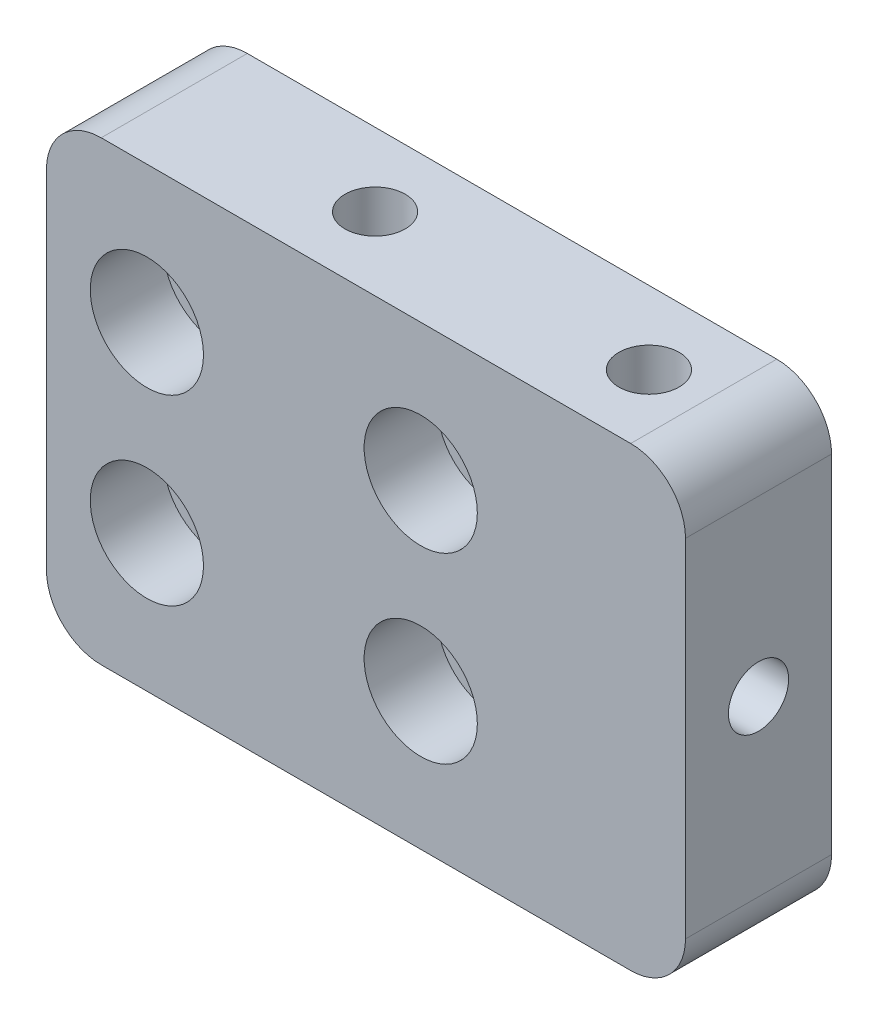
ISO-10303-21;
HEADER;
FILE_DESCRIPTION(('STEP AP214'),'2;1');
FILE_NAME('part.step','',(''),(''),'','','');
FILE_SCHEMA(('AUTOMOTIVE_DESIGN { 1 0 10303 214 1 1 1 1 }'));
ENDSEC;
DATA;
#1=APPLICATION_CONTEXT('core data for automotive mechanical design processes');
#2=APPLICATION_PROTOCOL_DEFINITION('international standard','automotive_design',2000,#1);
#3=PRODUCT_CONTEXT('',#1,'mechanical');
#4=PRODUCT('Part','Part','',(#3));
#5=PRODUCT_RELATED_PRODUCT_CATEGORY('part','',(#4));
#6=PRODUCT_DEFINITION_FORMATION('','',#4);
#7=PRODUCT_DEFINITION_CONTEXT('part definition',#1,'design');
#8=PRODUCT_DEFINITION('design','',#6,#7);
#9=PRODUCT_DEFINITION_SHAPE('','',#8);
#10=(LENGTH_UNIT() NAMED_UNIT(*) SI_UNIT(.MILLI.,.METRE.));
#11=(NAMED_UNIT(*) PLANE_ANGLE_UNIT() SI_UNIT($,.RADIAN.));
#12=(NAMED_UNIT(*) SI_UNIT($,.STERADIAN.) SOLID_ANGLE_UNIT());
#13=UNCERTAINTY_MEASURE_WITH_UNIT(LENGTH_MEASURE(1.E-05),#10,'distance_accuracy_value','');
#14=(GEOMETRIC_REPRESENTATION_CONTEXT(3) GLOBAL_UNCERTAINTY_ASSIGNED_CONTEXT((#13)) GLOBAL_UNIT_ASSIGNED_CONTEXT((#10,
#11,#12)) REPRESENTATION_CONTEXT('',''));
#15=CARTESIAN_POINT('',(0.,0.,0.));
#16=DIRECTION('',(0.,0.,1.));
#17=DIRECTION('',(1.,0.,0.));
#18=AXIS2_PLACEMENT_3D('',#15,#16,#17);
#19=CARTESIAN_POINT('',(11.4999999999974,-12.5,4.00000000000034));
#20=DIRECTION('',(0.,-1.,0.));
#21=DIRECTION('',(0.,0.,-1.));
#22=AXIS2_PLACEMENT_3D('',#19,#20,#21);
#23=CYLINDRICAL_SURFACE('',#22,1.64999999999999);
#24=CARTESIAN_POINT('',(11.4999999999974,-12.5,4.00000000000034));
#25=DIRECTION('',(0.,-1.,0.));
#26=DIRECTION('',(0.,0.,-1.));
#27=AXIS2_PLACEMENT_3D('',#24,#25,#26);
#28=CIRCLE('',#27,1.64999999999999);
#29=CARTESIAN_POINT('',(11.4999999999974,-12.5,2.35000000000035));
#30=VERTEX_POINT('',#29);
#31=EDGE_CURVE('E240',#30,#30,#28,.T.);
#32=ORIENTED_EDGE('',*,*,#31,.T.);
#33=EDGE_LOOP('',(#32));
#34=FACE_BOUND('',#33,.T.);
#35=CARTESIAN_POINT('',(11.4999999999974,9.07056374455095E-09,3.99999999995289));
#36=DIRECTION('',(0.707106781186547,-0.707106781186547,0.));
#37=DIRECTION('',(-0.707106781186547,-0.707106781186547,0.));
#38=AXIS2_PLACEMENT_3D('',#35,#36,#37);
#39=ELLIPSE('',#38,2.33345237791559,1.64999999999999);
#40=CARTESIAN_POINT('',(11.4999999999974,9.07056374455095E-09,2.3499999999529));
#41=VERTEX_POINT('',#40);
#42=CARTESIAN_POINT('',(11.4999999999974,9.07056374455095E-09,5.64999999995288));
#43=VERTEX_POINT('',#42);
#44=EDGE_CURVE('E52',#41,#43,#39,.F.);
#45=ORIENTED_EDGE('',*,*,#44,.T.);
#46=CARTESIAN_POINT('',(11.4999999999974,9.07056374455095E-09,3.99999999995289));
#47=DIRECTION('',(-0.707106781186547,-0.707106781186547,0.));
#48=DIRECTION('',(0.707106781186547,-0.707106781186547,0.));
#49=AXIS2_PLACEMENT_3D('',#46,#47,#48);
#50=ELLIPSE('',#49,2.33345237791559,1.64999999999999);
#51=EDGE_CURVE('E249',#43,#41,#50,.F.);
#52=ORIENTED_EDGE('',*,*,#51,.T.);
#53=EDGE_LOOP('',(#45,#52));
#54=FACE_BOUND('',#53,.T.);
#55=ADVANCED_FACE('F38',(#34,#54),#23,.F.);
#56=CARTESIAN_POINT('',(-3.50000000000261,-12.5,4.00000000000064));
#57=DIRECTION('',(0.,-1.,0.));
#58=DIRECTION('',(0.,0.,-1.));
#59=AXIS2_PLACEMENT_3D('',#56,#57,#58);
#60=CYLINDRICAL_SURFACE('',#59,1.64999999999999);
#61=CARTESIAN_POINT('',(-3.50000000000261,-12.5,4.00000000000064));
#62=DIRECTION('',(0.,-1.,0.));
#63=DIRECTION('',(0.,0.,-1.));
#64=AXIS2_PLACEMENT_3D('',#61,#62,#63);
#65=CIRCLE('',#64,1.64999999999999);
#66=CARTESIAN_POINT('',(-3.50000000000261,-12.5,2.35000000000065));
#67=VERTEX_POINT('',#66);
#68=EDGE_CURVE('E246',#67,#67,#65,.T.);
#69=ORIENTED_EDGE('',*,*,#68,.T.);
#70=EDGE_LOOP('',(#69));
#71=FACE_BOUND('',#70,.T.);
#72=CARTESIAN_POINT('',(-3.50000000000261,9.07056374455095E-09,3.99999999995304));
#73=DIRECTION('',(0.707106781186547,-0.707106781186547,0.));
#74=DIRECTION('',(-0.707106781186547,-0.707106781186547,0.));
#75=AXIS2_PLACEMENT_3D('',#72,#73,#74);
#76=ELLIPSE('',#75,2.33345237791559,1.64999999999999);
#77=CARTESIAN_POINT('',(-3.50000000000261,9.07056374455095E-09,2.34999999995305));
#78=VERTEX_POINT('',#77);
#79=CARTESIAN_POINT('',(-3.50000000000261,9.07056374455095E-09,5.64999999995304));
#80=VERTEX_POINT('',#79);
#81=EDGE_CURVE('E58',#78,#80,#76,.F.);
#82=ORIENTED_EDGE('',*,*,#81,.T.);
#83=CARTESIAN_POINT('',(-3.50000000000261,9.07056374455095E-09,3.99999999995304));
#84=DIRECTION('',(-0.707106781186547,-0.707106781186547,0.));
#85=DIRECTION('',(0.707106781186547,-0.707106781186547,0.));
#86=AXIS2_PLACEMENT_3D('',#83,#84,#85);
#87=ELLIPSE('',#86,2.33345237791559,1.64999999999999);
#88=EDGE_CURVE('E11',#80,#78,#87,.F.);
#89=ORIENTED_EDGE('',*,*,#88,.T.);
#90=EDGE_LOOP('',(#82,#89));
#91=FACE_BOUND('',#90,.T.);
#92=ADVANCED_FACE('F126',(#71,#91),#60,.F.);
#93=CARTESIAN_POINT('',(2.9999999999998,5.00000000806245,0.));
#94=DIRECTION('',(0.,0.,1.));
#95=DIRECTION('',(1.,0.,0.));
#96=AXIS2_PLACEMENT_3D('',#93,#94,#95);
#97=CYLINDRICAL_SURFACE('',#96,1.52499999822959);
#98=CARTESIAN_POINT('',(2.9999999999998,5.00000000806245,0.));
#99=DIRECTION('',(0.,0.,1.));
#100=DIRECTION('',(1.,0.,0.));
#101=AXIS2_PLACEMENT_3D('',#98,#99,#100);
#102=CIRCLE('',#101,1.52499999822959);
#103=CARTESIAN_POINT('',(4.52499999822939,5.00000000806245,0.));
#104=VERTEX_POINT('',#103);
#105=EDGE_CURVE('E193',#104,#104,#102,.T.);
#106=ORIENTED_EDGE('',*,*,#105,.F.);
#107=EDGE_LOOP('',(#106));
#108=FACE_BOUND('',#107,.T.);
#109=CARTESIAN_POINT('',(2.9999999999998,5.00000000806245,4.));
#110=DIRECTION('',(0.,0.,1.));
#111=DIRECTION('',(1.,0.,0.));
#112=AXIS2_PLACEMENT_3D('',#109,#110,#111);
#113=CIRCLE('',#112,1.52499999822959);
#114=CARTESIAN_POINT('',(4.52499999822939,5.00000000806245,4.));
#115=VERTEX_POINT('',#114);
#116=EDGE_CURVE('E130',#115,#115,#113,.F.);
#117=ORIENTED_EDGE('',*,*,#116,.F.);
#118=EDGE_LOOP('',(#117));
#119=FACE_BOUND('',#118,.T.);
#120=ADVANCED_FACE('F326',(#108,#119),#97,.F.);
#121=CARTESIAN_POINT('',(-12.0000000000002,-4.99999999193755,0.));
#122=DIRECTION('',(0.,0.,1.));
#123=DIRECTION('',(1.,0.,0.));
#124=AXIS2_PLACEMENT_3D('',#121,#122,#123);
#125=CYLINDRICAL_SURFACE('',#124,1.52499999822906);
#126=CARTESIAN_POINT('',(-12.0000000000002,-4.99999999193755,0.));
#127=DIRECTION('',(0.,0.,1.));
#128=DIRECTION('',(1.,0.,0.));
#129=AXIS2_PLACEMENT_3D('',#126,#127,#128);
#130=CIRCLE('',#129,1.52499999822906);
#131=CARTESIAN_POINT('',(-10.4750000017711,-4.99999999193755,0.));
#132=VERTEX_POINT('',#131);
#133=EDGE_CURVE('E133',#132,#132,#130,.T.);
#134=ORIENTED_EDGE('',*,*,#133,.F.);
#135=EDGE_LOOP('',(#134));
#136=FACE_BOUND('',#135,.T.);
#137=CARTESIAN_POINT('',(-12.0000000000002,-4.99999999193755,4.));
#138=DIRECTION('',(0.,0.,1.));
#139=DIRECTION('',(1.,0.,0.));
#140=AXIS2_PLACEMENT_3D('',#137,#138,#139);
#141=CIRCLE('',#140,1.52499999822906);
#142=CARTESIAN_POINT('',(-10.4750000017711,-4.99999999193755,4.));
#143=VERTEX_POINT('',#142);
#144=EDGE_CURVE('E134',#143,#143,#141,.F.);
#145=ORIENTED_EDGE('',*,*,#144,.F.);
#146=EDGE_LOOP('',(#145));
#147=FACE_BOUND('',#146,.T.);
#148=ADVANCED_FACE('F380',(#136,#147),#125,.F.);
#149=CARTESIAN_POINT('',(-12.0000000000002,5.00000000806245,0.));
#150=DIRECTION('',(0.,0.,1.));
#151=DIRECTION('',(1.,0.,0.));
#152=AXIS2_PLACEMENT_3D('',#149,#150,#151);
#153=CYLINDRICAL_SURFACE('',#152,1.52499999822907);
#154=CARTESIAN_POINT('',(-12.0000000000002,5.00000000806245,0.));
#155=DIRECTION('',(0.,0.,1.));
#156=DIRECTION('',(1.,0.,0.));
#157=AXIS2_PLACEMENT_3D('',#154,#155,#156);
#158=CIRCLE('',#157,1.52499999822907);
#159=CARTESIAN_POINT('',(-10.4750000017711,5.00000000806245,0.));
#160=VERTEX_POINT('',#159);
#161=EDGE_CURVE('E207',#160,#160,#158,.T.);
#162=ORIENTED_EDGE('',*,*,#161,.F.);
#163=EDGE_LOOP('',(#162));
#164=FACE_BOUND('',#163,.T.);
#165=CARTESIAN_POINT('',(-12.0000000000002,5.00000000806245,4.));
#166=DIRECTION('',(0.,0.,1.));
#167=DIRECTION('',(1.,0.,0.));
#168=AXIS2_PLACEMENT_3D('',#165,#166,#167);
#169=CIRCLE('',#168,1.52499999822907);
#170=CARTESIAN_POINT('',(-10.4750000017711,5.00000000806245,4.));
#171=VERTEX_POINT('',#170);
#172=EDGE_CURVE('E137',#171,#171,#169,.F.);
#173=ORIENTED_EDGE('',*,*,#172,.F.);
#174=EDGE_LOOP('',(#173));
#175=FACE_BOUND('',#174,.T.);
#176=ADVANCED_FACE('F383',(#164,#175),#153,.F.);
#177=CARTESIAN_POINT('',(2.9999999999998,-4.99999999193757,0.));
#178=DIRECTION('',(0.,0.,1.));
#179=DIRECTION('',(1.,0.,0.));
#180=AXIS2_PLACEMENT_3D('',#177,#178,#179);
#181=CYLINDRICAL_SURFACE('',#180,1.52499999822959);
#182=CARTESIAN_POINT('',(2.9999999999998,-4.99999999193757,0.));
#183=DIRECTION('',(0.,0.,1.));
#184=DIRECTION('',(1.,0.,0.));
#185=AXIS2_PLACEMENT_3D('',#182,#183,#184);
#186=CIRCLE('',#185,1.52499999822959);
#187=CARTESIAN_POINT('',(4.52499999822939,-4.99999999193757,0.));
#188=VERTEX_POINT('',#187);
#189=EDGE_CURVE('E206',#188,#188,#186,.T.);
#190=ORIENTED_EDGE('',*,*,#189,.F.);
#191=EDGE_LOOP('',(#190));
#192=FACE_BOUND('',#191,.T.);
#193=CARTESIAN_POINT('',(2.9999999999998,-4.99999999193757,4.));
#194=DIRECTION('',(0.,0.,1.));
#195=DIRECTION('',(1.,0.,0.));
#196=AXIS2_PLACEMENT_3D('',#193,#194,#195);
#197=CIRCLE('',#196,1.52499999822959);
#198=CARTESIAN_POINT('',(4.52499999822939,-4.99999999193757,4.));
#199=VERTEX_POINT('',#198);
#200=EDGE_CURVE('E140',#199,#199,#197,.F.);
#201=ORIENTED_EDGE('',*,*,#200,.F.);
#202=EDGE_LOOP('',(#201));
#203=FACE_BOUND('',#202,.T.);
#204=ADVANCED_FACE('F349',(#192,#203),#181,.F.);
#205=CARTESIAN_POINT('',(17.5,-12.5,8.));
#206=DIRECTION('',(-1.,0.,0.));
#207=DIRECTION('',(0.,0.,1.));
#208=AXIS2_PLACEMENT_3D('',#205,#206,#207);
#209=PLANE('',#208);
#210=CARTESIAN_POINT('',(17.5,9.07056374455095E-09,3.99999999990545));
#211=DIRECTION('',(-1.,0.,0.));
#212=DIRECTION('',(0.,0.,1.));
#213=AXIS2_PLACEMENT_3D('',#210,#211,#212);
#214=CIRCLE('',#213,1.64999999999999);
#215=CARTESIAN_POINT('',(17.5,9.07056374455095E-09,5.64999999990544));
#216=VERTEX_POINT('',#215);
#217=EDGE_CURVE('E258',#216,#216,#214,.T.);
#218=ORIENTED_EDGE('',*,*,#217,.T.);
#219=EDGE_LOOP('',(#218));
#220=FACE_BOUND('',#219,.T.);
#221=DIRECTION('',(0.,1.,0.));
#222=VECTOR('',#221,1.);
#223=CARTESIAN_POINT('',(17.5,-12.5,8.));
#224=LINE('',#223,#222);
#225=CARTESIAN_POINT('',(17.5,-9.5,8.));
#226=VERTEX_POINT('',#225);
#227=CARTESIAN_POINT('',(17.5,9.5,8.));
#228=VERTEX_POINT('',#227);
#229=EDGE_CURVE('E183',#226,#228,#224,.T.);
#230=ORIENTED_EDGE('',*,*,#229,.F.);
#231=DIRECTION('',(0.,0.,-1.));
#232=VECTOR('',#231,1.);
#233=CARTESIAN_POINT('',(17.5,-9.5,8.));
#234=LINE('',#233,#232);
#235=CARTESIAN_POINT('',(17.5,-9.5,0.));
#236=VERTEX_POINT('',#235);
#237=EDGE_CURVE('E174',#226,#236,#234,.T.);
#238=ORIENTED_EDGE('',*,*,#237,.T.);
#239=DIRECTION('',(0.,1.,0.));
#240=VECTOR('',#239,1.);
#241=CARTESIAN_POINT('',(17.5,-12.5,0.));
#242=LINE('',#241,#240);
#243=CARTESIAN_POINT('',(17.5,9.5,0.));
#244=VERTEX_POINT('',#243);
#245=EDGE_CURVE('E190',#236,#244,#242,.T.);
#246=ORIENTED_EDGE('',*,*,#245,.T.);
#247=DIRECTION('',(0.,0.,-1.));
#248=VECTOR('',#247,1.);
#249=CARTESIAN_POINT('',(17.5,9.5,8.));
#250=LINE('',#249,#248);
#251=EDGE_CURVE('E177',#244,#228,#250,.F.);
#252=ORIENTED_EDGE('',*,*,#251,.T.);
#253=EDGE_LOOP('',(#230,#238,#246,#252));
#254=FACE_BOUND('',#253,.T.);
#255=ADVANCED_FACE('F294',(#220,#254),#209,.F.);
#256=CARTESIAN_POINT('',(-17.5,12.5,8.));
#257=DIRECTION('',(0.,-1.,0.));
#258=DIRECTION('',(0.,0.,-1.));
#259=AXIS2_PLACEMENT_3D('',#256,#257,#258);
#260=PLANE('',#259);
#261=CARTESIAN_POINT('',(-3.50000000000261,12.5,4.00000000000064));
#262=DIRECTION('',(0.,-1.,0.));
#263=DIRECTION('',(0.,0.,-1.));
#264=AXIS2_PLACEMENT_3D('',#261,#262,#263);
#265=CIRCLE('',#264,1.65);
#266=CARTESIAN_POINT('',(-3.50000000000261,12.5,2.35000000000065));
#267=VERTEX_POINT('',#266);
#268=EDGE_CURVE('E243',#267,#267,#265,.T.);
#269=ORIENTED_EDGE('',*,*,#268,.T.);
#270=EDGE_LOOP('',(#269));
#271=FACE_BOUND('',#270,.T.);
#272=CARTESIAN_POINT('',(11.4999999999974,12.5,4.00000000000034));
#273=DIRECTION('',(0.,-1.,0.));
#274=DIRECTION('',(0.,0.,-1.));
#275=AXIS2_PLACEMENT_3D('',#272,#273,#274);
#276=CIRCLE('',#275,1.65);
#277=CARTESIAN_POINT('',(11.4999999999974,12.5,2.35000000000034));
#278=VERTEX_POINT('',#277);
#279=EDGE_CURVE('E235',#278,#278,#276,.T.);
#280=ORIENTED_EDGE('',*,*,#279,.T.);
#281=EDGE_LOOP('',(#280));
#282=FACE_BOUND('',#281,.T.);
#283=DIRECTION('',(-1.,0.,0.));
#284=VECTOR('',#283,1.);
#285=CARTESIAN_POINT('',(-17.5,12.5,8.));
#286=LINE('',#285,#284);
#287=CARTESIAN_POINT('',(14.5,12.5,8.));
#288=VERTEX_POINT('',#287);
#289=CARTESIAN_POINT('',(-14.5,12.5,8.));
#290=VERTEX_POINT('',#289);
#291=EDGE_CURVE('E199',#288,#290,#286,.T.);
#292=ORIENTED_EDGE('',*,*,#291,.F.);
#293=DIRECTION('',(0.,0.,-1.));
#294=VECTOR('',#293,1.);
#295=CARTESIAN_POINT('',(14.5,12.5,8.));
#296=LINE('',#295,#294);
#297=CARTESIAN_POINT('',(14.5,12.5,0.));
#298=VERTEX_POINT('',#297);
#299=EDGE_CURVE('E124',#288,#298,#296,.T.);
#300=ORIENTED_EDGE('',*,*,#299,.T.);
#301=DIRECTION('',(-1.,0.,0.));
#302=VECTOR('',#301,1.);
#303=CARTESIAN_POINT('',(-17.5,12.5,0.));
#304=LINE('',#303,#302);
#305=CARTESIAN_POINT('',(-14.5,12.5,0.));
#306=VERTEX_POINT('',#305);
#307=EDGE_CURVE('E187',#298,#306,#304,.T.);
#308=ORIENTED_EDGE('',*,*,#307,.T.);
#309=DIRECTION('',(0.,0.,-1.));
#310=VECTOR('',#309,1.);
#311=CARTESIAN_POINT('',(-14.5,12.5,8.));
#312=LINE('',#311,#310);
#313=EDGE_CURVE('E146',#306,#290,#312,.F.);
#314=ORIENTED_EDGE('',*,*,#313,.T.);
#315=EDGE_LOOP('',(#292,#300,#308,#314));
#316=FACE_BOUND('',#315,.T.);
#317=ADVANCED_FACE('F270',(#271,#282,#316),#260,.F.);
#318=CARTESIAN_POINT('',(-17.5,-12.5,8.));
#319=DIRECTION('',(1.,0.,0.));
#320=DIRECTION('',(0.,0.,-1.));
#321=AXIS2_PLACEMENT_3D('',#318,#319,#320);
#322=PLANE('',#321);
#323=CARTESIAN_POINT('',(-17.5,9.07056374455095E-09,3.99999999990545));
#324=DIRECTION('',(-1.,0.,0.));
#325=DIRECTION('',(0.,0.,1.));
#326=AXIS2_PLACEMENT_3D('',#323,#324,#325);
#327=CIRCLE('',#326,1.64999999999999);
#328=CARTESIAN_POINT('',(-17.5,9.07056374455095E-09,5.64999999990544));
#329=VERTEX_POINT('',#328);
#330=EDGE_CURVE('E261',#329,#329,#327,.T.);
#331=ORIENTED_EDGE('',*,*,#330,.F.);
#332=EDGE_LOOP('',(#331));
#333=FACE_BOUND('',#332,.T.);
#334=DIRECTION('',(0.,-1.,0.));
#335=VECTOR('',#334,1.);
#336=CARTESIAN_POINT('',(-17.5,-12.5,0.));
#337=LINE('',#336,#335);
#338=CARTESIAN_POINT('',(-17.5,9.5,0.));
#339=VERTEX_POINT('',#338);
#340=CARTESIAN_POINT('',(-17.5,-9.5,0.));
#341=VERTEX_POINT('',#340);
#342=EDGE_CURVE('E184',#339,#341,#337,.T.);
#343=ORIENTED_EDGE('',*,*,#342,.T.);
#344=DIRECTION('',(0.,0.,-1.));
#345=VECTOR('',#344,1.);
#346=CARTESIAN_POINT('',(-17.5,-9.5,8.));
#347=LINE('',#346,#345);
#348=CARTESIAN_POINT('',(-17.5,-9.5,8.));
#349=VERTEX_POINT('',#348);
#350=EDGE_CURVE('E148',#341,#349,#347,.F.);
#351=ORIENTED_EDGE('',*,*,#350,.T.);
#352=DIRECTION('',(0.,-1.,0.));
#353=VECTOR('',#352,1.);
#354=CARTESIAN_POINT('',(-17.5,-12.5,8.));
#355=LINE('',#354,#353);
#356=CARTESIAN_POINT('',(-17.5,9.5,8.));
#357=VERTEX_POINT('',#356);
#358=EDGE_CURVE('E196',#357,#349,#355,.T.);
#359=ORIENTED_EDGE('',*,*,#358,.F.);
#360=DIRECTION('',(0.,0.,-1.));
#361=VECTOR('',#360,1.);
#362=CARTESIAN_POINT('',(-17.5,9.5,8.));
#363=LINE('',#362,#361);
#364=EDGE_CURVE('E150',#357,#339,#363,.T.);
#365=ORIENTED_EDGE('',*,*,#364,.T.);
#366=EDGE_LOOP('',(#343,#351,#359,#365));
#367=FACE_BOUND('',#366,.T.);
#368=ADVANCED_FACE('F266',(#333,#367),#322,.F.);
#369=CARTESIAN_POINT('',(-17.5,-12.5,8.));
#370=DIRECTION('',(0.,1.,0.));
#371=DIRECTION('',(0.,0.,1.));
#372=AXIS2_PLACEMENT_3D('',#369,#370,#371);
#373=PLANE('',#372);
#374=ORIENTED_EDGE('',*,*,#68,.F.);
#375=EDGE_LOOP('',(#374));
#376=FACE_BOUND('',#375,.T.);
#377=ORIENTED_EDGE('',*,*,#31,.F.);
#378=EDGE_LOOP('',(#377));
#379=FACE_BOUND('',#378,.T.);
#380=DIRECTION('',(1.,0.,0.));
#381=VECTOR('',#380,1.);
#382=CARTESIAN_POINT('',(-17.5,-12.5,0.));
#383=LINE('',#382,#381);
#384=CARTESIAN_POINT('',(-14.5,-12.5,0.));
#385=VERTEX_POINT('',#384);
#386=CARTESIAN_POINT('',(14.5,-12.5,0.));
#387=VERTEX_POINT('',#386);
#388=EDGE_CURVE('E180',#385,#387,#383,.T.);
#389=ORIENTED_EDGE('',*,*,#388,.T.);
#390=DIRECTION('',(0.,0.,-1.));
#391=VECTOR('',#390,1.);
#392=CARTESIAN_POINT('',(14.5,-12.5,8.));
#393=LINE('',#392,#391);
#394=CARTESIAN_POINT('',(14.5,-12.5,8.));
#395=VERTEX_POINT('',#394);
#396=EDGE_CURVE('E161',#387,#395,#393,.F.);
#397=ORIENTED_EDGE('',*,*,#396,.T.);
#398=DIRECTION('',(1.,0.,0.));
#399=VECTOR('',#398,1.);
#400=CARTESIAN_POINT('',(-17.5,-12.5,8.));
#401=LINE('',#400,#399);
#402=CARTESIAN_POINT('',(-14.5,-12.5,8.));
#403=VERTEX_POINT('',#402);
#404=EDGE_CURVE('E179',#403,#395,#401,.T.);
#405=ORIENTED_EDGE('',*,*,#404,.F.);
#406=DIRECTION('',(0.,0.,-1.));
#407=VECTOR('',#406,1.);
#408=CARTESIAN_POINT('',(-14.5,-12.5,8.));
#409=LINE('',#408,#407);
#410=EDGE_CURVE('E163',#403,#385,#409,.T.);
#411=ORIENTED_EDGE('',*,*,#410,.T.);
#412=EDGE_LOOP('',(#389,#397,#405,#411));
#413=FACE_BOUND('',#412,.T.);
#414=ADVANCED_FACE('F269',(#376,#379,#413),#373,.F.);
#415=CARTESIAN_POINT('',(0.,0.,8.));
#416=DIRECTION('',(0.,0.,-1.));
#417=DIRECTION('',(-1.,0.,0.));
#418=AXIS2_PLACEMENT_3D('',#415,#416,#417);
#419=PLANE('',#418);
#420=CARTESIAN_POINT('',(-12.0000000000002,5.00000000806245,8.));
#421=DIRECTION('',(0.,0.,1.));
#422=DIRECTION('',(1.,0.,0.));
#423=AXIS2_PLACEMENT_3D('',#420,#421,#422);
#424=CIRCLE('',#423,3.09999999822907);
#425=CARTESIAN_POINT('',(-8.90000000177111,5.00000000806245,8.));
#426=VERTEX_POINT('',#425);
#427=EDGE_CURVE('E227',#426,#426,#424,.T.);
#428=ORIENTED_EDGE('',*,*,#427,.F.);
#429=EDGE_LOOP('',(#428));
#430=FACE_BOUND('',#429,.T.);
#431=CARTESIAN_POINT('',(2.9999999999998,-4.99999999193757,8.));
#432=DIRECTION('',(0.,0.,1.));
#433=DIRECTION('',(1.,0.,0.));
#434=AXIS2_PLACEMENT_3D('',#431,#432,#433);
#435=CIRCLE('',#434,3.09999999822959);
#436=CARTESIAN_POINT('',(6.09999999822939,-4.99999999193757,8.));
#437=VERTEX_POINT('',#436);
#438=EDGE_CURVE('E220',#437,#437,#435,.T.);
#439=ORIENTED_EDGE('',*,*,#438,.F.);
#440=EDGE_LOOP('',(#439));
#441=FACE_BOUND('',#440,.T.);
#442=CARTESIAN_POINT('',(-12.0000000000002,-4.99999999193755,8.));
#443=DIRECTION('',(0.,0.,1.));
#444=DIRECTION('',(1.,0.,0.));
#445=AXIS2_PLACEMENT_3D('',#442,#443,#444);
#446=CIRCLE('',#445,3.09999999822906);
#447=CARTESIAN_POINT('',(-8.90000000177111,-4.99999999193755,8.));
#448=VERTEX_POINT('',#447);
#449=EDGE_CURVE('E232',#448,#448,#446,.T.);
#450=ORIENTED_EDGE('',*,*,#449,.F.);
#451=EDGE_LOOP('',(#450));
#452=FACE_BOUND('',#451,.T.);
#453=CARTESIAN_POINT('',(2.9999999999998,5.00000000806245,8.));
#454=DIRECTION('',(0.,0.,1.));
#455=DIRECTION('',(1.,0.,0.));
#456=AXIS2_PLACEMENT_3D('',#453,#454,#455);
#457=CIRCLE('',#456,3.09999999822959);
#458=CARTESIAN_POINT('',(6.09999999822939,5.00000000806245,8.));
#459=VERTEX_POINT('',#458);
#460=EDGE_CURVE('E214',#459,#459,#457,.T.);
#461=ORIENTED_EDGE('',*,*,#460,.F.);
#462=EDGE_LOOP('',(#461));
#463=FACE_BOUND('',#462,.T.);
#464=ORIENTED_EDGE('',*,*,#404,.T.);
#465=CARTESIAN_POINT('',(14.5,-9.5,8.));
#466=DIRECTION('',(0.,0.,-1.));
#467=DIRECTION('',(-1.,0.,0.));
#468=AXIS2_PLACEMENT_3D('',#465,#466,#467);
#469=CIRCLE('',#468,3.);
#470=EDGE_CURVE('E153',#395,#226,#469,.F.);
#471=ORIENTED_EDGE('',*,*,#470,.T.);
#472=ORIENTED_EDGE('',*,*,#229,.T.);
#473=CARTESIAN_POINT('',(14.5,9.5,8.));
#474=DIRECTION('',(0.,0.,-1.));
#475=DIRECTION('',(-1.,0.,0.));
#476=AXIS2_PLACEMENT_3D('',#473,#474,#475);
#477=CIRCLE('',#476,3.);
#478=EDGE_CURVE('E157',#228,#288,#477,.F.);
#479=ORIENTED_EDGE('',*,*,#478,.T.);
#480=ORIENTED_EDGE('',*,*,#291,.T.);
#481=CARTESIAN_POINT('',(-14.5,9.5,8.));
#482=DIRECTION('',(0.,0.,-1.));
#483=DIRECTION('',(-1.,0.,0.));
#484=AXIS2_PLACEMENT_3D('',#481,#482,#483);
#485=CIRCLE('',#484,3.);
#486=EDGE_CURVE('E159',#290,#357,#485,.F.);
#487=ORIENTED_EDGE('',*,*,#486,.T.);
#488=ORIENTED_EDGE('',*,*,#358,.T.);
#489=CARTESIAN_POINT('',(-14.5,-9.5,8.));
#490=DIRECTION('',(0.,0.,-1.));
#491=DIRECTION('',(-1.,0.,0.));
#492=AXIS2_PLACEMENT_3D('',#489,#490,#491);
#493=CIRCLE('',#492,3.);
#494=EDGE_CURVE('E155',#349,#403,#493,.F.);
#495=ORIENTED_EDGE('',*,*,#494,.T.);
#496=EDGE_LOOP('',(#464,#471,#472,#479,#480,#487,#488,#495));
#497=FACE_BOUND('',#496,.T.);
#498=ADVANCED_FACE('F283',(#430,#441,#452,#463,#497),#419,.F.);
#499=CARTESIAN_POINT('',(0.,0.,0.));
#500=DIRECTION('',(0.,0.,-1.));
#501=DIRECTION('',(-1.,0.,0.));
#502=AXIS2_PLACEMENT_3D('',#499,#500,#501);
#503=PLANE('',#502);
#504=ORIENTED_EDGE('',*,*,#189,.T.);
#505=EDGE_LOOP('',(#504));
#506=FACE_BOUND('',#505,.T.);
#507=ORIENTED_EDGE('',*,*,#161,.T.);
#508=EDGE_LOOP('',(#507));
#509=FACE_BOUND('',#508,.T.);
#510=ORIENTED_EDGE('',*,*,#133,.T.);
#511=EDGE_LOOP('',(#510));
#512=FACE_BOUND('',#511,.T.);
#513=ORIENTED_EDGE('',*,*,#105,.T.);
#514=EDGE_LOOP('',(#513));
#515=FACE_BOUND('',#514,.T.);
#516=ORIENTED_EDGE('',*,*,#245,.F.);
#517=CARTESIAN_POINT('',(14.5,-9.5,0.));
#518=DIRECTION('',(0.,0.,-1.));
#519=DIRECTION('',(-1.,0.,0.));
#520=AXIS2_PLACEMENT_3D('',#517,#518,#519);
#521=CIRCLE('',#520,3.);
#522=EDGE_CURVE('E166',#236,#387,#521,.T.);
#523=ORIENTED_EDGE('',*,*,#522,.T.);
#524=ORIENTED_EDGE('',*,*,#388,.F.);
#525=CARTESIAN_POINT('',(-14.5,-9.5,0.));
#526=DIRECTION('',(0.,0.,-1.));
#527=DIRECTION('',(-1.,0.,0.));
#528=AXIS2_PLACEMENT_3D('',#525,#526,#527);
#529=CIRCLE('',#528,3.);
#530=EDGE_CURVE('E168',#385,#341,#529,.T.);
#531=ORIENTED_EDGE('',*,*,#530,.T.);
#532=ORIENTED_EDGE('',*,*,#342,.F.);
#533=CARTESIAN_POINT('',(-14.5,9.5,0.));
#534=DIRECTION('',(0.,0.,-1.));
#535=DIRECTION('',(-1.,0.,0.));
#536=AXIS2_PLACEMENT_3D('',#533,#534,#535);
#537=CIRCLE('',#536,3.);
#538=EDGE_CURVE('E172',#339,#306,#537,.T.);
#539=ORIENTED_EDGE('',*,*,#538,.T.);
#540=ORIENTED_EDGE('',*,*,#307,.F.);
#541=CARTESIAN_POINT('',(14.5,9.5,0.));
#542=DIRECTION('',(0.,0.,-1.));
#543=DIRECTION('',(-1.,0.,0.));
#544=AXIS2_PLACEMENT_3D('',#541,#542,#543);
#545=CIRCLE('',#544,3.);
#546=EDGE_CURVE('E170',#298,#244,#545,.T.);
#547=ORIENTED_EDGE('',*,*,#546,.T.);
#548=EDGE_LOOP('',(#516,#523,#524,#531,#532,#539,#540,#547));
#549=FACE_BOUND('',#548,.T.);
#550=ADVANCED_FACE('F306',(#506,#509,#512,#515,#549),#503,.T.);
#551=CARTESIAN_POINT('',(14.5,-9.5,8.));
#552=DIRECTION('',(0.,0.,-1.));
#553=DIRECTION('',(-1.,0.,0.));
#554=AXIS2_PLACEMENT_3D('',#551,#552,#553);
#555=CYLINDRICAL_SURFACE('',#554,3.);
#556=ORIENTED_EDGE('',*,*,#470,.F.);
#557=ORIENTED_EDGE('',*,*,#396,.F.);
#558=ORIENTED_EDGE('',*,*,#522,.F.);
#559=ORIENTED_EDGE('',*,*,#237,.F.);
#560=EDGE_LOOP('',(#556,#557,#558,#559));
#561=FACE_BOUND('',#560,.T.);
#562=ADVANCED_FACE('F289',(#561),#555,.T.);
#563=CARTESIAN_POINT('',(-14.5,-9.5,8.));
#564=DIRECTION('',(0.,0.,-1.));
#565=DIRECTION('',(-1.,0.,0.));
#566=AXIS2_PLACEMENT_3D('',#563,#564,#565);
#567=CYLINDRICAL_SURFACE('',#566,3.);
#568=ORIENTED_EDGE('',*,*,#494,.F.);
#569=ORIENTED_EDGE('',*,*,#350,.F.);
#570=ORIENTED_EDGE('',*,*,#530,.F.);
#571=ORIENTED_EDGE('',*,*,#410,.F.);
#572=EDGE_LOOP('',(#568,#569,#570,#571));
#573=FACE_BOUND('',#572,.T.);
#574=ADVANCED_FACE('F279',(#573),#567,.T.);
#575=CARTESIAN_POINT('',(14.5,9.5,8.));
#576=DIRECTION('',(0.,0.,-1.));
#577=DIRECTION('',(-1.,0.,0.));
#578=AXIS2_PLACEMENT_3D('',#575,#576,#577);
#579=CYLINDRICAL_SURFACE('',#578,3.);
#580=ORIENTED_EDGE('',*,*,#478,.F.);
#581=ORIENTED_EDGE('',*,*,#251,.F.);
#582=ORIENTED_EDGE('',*,*,#546,.F.);
#583=ORIENTED_EDGE('',*,*,#299,.F.);
#584=EDGE_LOOP('',(#580,#581,#582,#583));
#585=FACE_BOUND('',#584,.T.);
#586=ADVANCED_FACE('F298',(#585),#579,.T.);
#587=CARTESIAN_POINT('',(-14.5,9.5,8.));
#588=DIRECTION('',(0.,0.,-1.));
#589=DIRECTION('',(-1.,0.,0.));
#590=AXIS2_PLACEMENT_3D('',#587,#588,#589);
#591=CYLINDRICAL_SURFACE('',#590,3.);
#592=ORIENTED_EDGE('',*,*,#486,.F.);
#593=ORIENTED_EDGE('',*,*,#313,.F.);
#594=ORIENTED_EDGE('',*,*,#538,.F.);
#595=ORIENTED_EDGE('',*,*,#364,.F.);
#596=EDGE_LOOP('',(#592,#593,#594,#595));
#597=FACE_BOUND('',#596,.T.);
#598=ADVANCED_FACE('F40',(#597),#591,.T.);
#599=CARTESIAN_POINT('',(2.9999999999998,-4.99999999193757,4.));
#600=DIRECTION('',(0.,0.,1.));
#601=DIRECTION('',(1.,0.,0.));
#602=AXIS2_PLACEMENT_3D('',#599,#600,#601);
#603=PLANE('',#602);
#604=CARTESIAN_POINT('',(2.9999999999998,-4.99999999193757,4.));
#605=DIRECTION('',(0.,0.,1.));
#606=DIRECTION('',(1.,0.,0.));
#607=AXIS2_PLACEMENT_3D('',#604,#605,#606);
#608=CIRCLE('',#607,3.09999999822959);
#609=CARTESIAN_POINT('',(6.09999999822939,-4.99999999193757,4.));
#610=VERTEX_POINT('',#609);
#611=EDGE_CURVE('E223',#610,#610,#608,.T.);
#612=ORIENTED_EDGE('',*,*,#611,.T.);
#613=EDGE_LOOP('',(#612));
#614=FACE_BOUND('',#613,.T.);
#615=ORIENTED_EDGE('',*,*,#200,.T.);
#616=EDGE_LOOP('',(#615));
#617=FACE_BOUND('',#616,.T.);
#618=ADVANCED_FACE('F358',(#614,#617),#603,.T.);
#619=CARTESIAN_POINT('',(2.9999999999998,-4.99999999193757,4.));
#620=DIRECTION('',(0.,0.,1.));
#621=DIRECTION('',(1.,0.,0.));
#622=AXIS2_PLACEMENT_3D('',#619,#620,#621);
#623=CYLINDRICAL_SURFACE('',#622,3.09999999822959);
#624=ORIENTED_EDGE('',*,*,#611,.F.);
#625=EDGE_LOOP('',(#624));
#626=FACE_BOUND('',#625,.T.);
#627=ORIENTED_EDGE('',*,*,#438,.T.);
#628=EDGE_LOOP('',(#627));
#629=FACE_BOUND('',#628,.T.);
#630=ADVANCED_FACE('F362',(#626,#629),#623,.F.);
#631=CARTESIAN_POINT('',(-12.0000000000002,5.00000000806245,4.));
#632=DIRECTION('',(0.,0.,1.));
#633=DIRECTION('',(1.,0.,0.));
#634=AXIS2_PLACEMENT_3D('',#631,#632,#633);
#635=PLANE('',#634);
#636=CARTESIAN_POINT('',(-12.0000000000002,5.00000000806245,4.));
#637=DIRECTION('',(0.,0.,1.));
#638=DIRECTION('',(1.,0.,0.));
#639=AXIS2_PLACEMENT_3D('',#636,#637,#638);
#640=CIRCLE('',#639,3.09999999822907);
#641=CARTESIAN_POINT('',(-8.90000000177111,5.00000000806245,4.));
#642=VERTEX_POINT('',#641);
#643=EDGE_CURVE('E217',#642,#642,#640,.T.);
#644=ORIENTED_EDGE('',*,*,#643,.T.);
#645=EDGE_LOOP('',(#644));
#646=FACE_BOUND('',#645,.T.);
#647=ORIENTED_EDGE('',*,*,#172,.T.);
#648=EDGE_LOOP('',(#647));
#649=FACE_BOUND('',#648,.T.);
#650=ADVANCED_FACE('F368',(#646,#649),#635,.T.);
#651=CARTESIAN_POINT('',(-12.0000000000002,5.00000000806245,4.));
#652=DIRECTION('',(0.,0.,1.));
#653=DIRECTION('',(1.,0.,0.));
#654=AXIS2_PLACEMENT_3D('',#651,#652,#653);
#655=CYLINDRICAL_SURFACE('',#654,3.09999999822907);
#656=ORIENTED_EDGE('',*,*,#643,.F.);
#657=EDGE_LOOP('',(#656));
#658=FACE_BOUND('',#657,.T.);
#659=ORIENTED_EDGE('',*,*,#427,.T.);
#660=EDGE_LOOP('',(#659));
#661=FACE_BOUND('',#660,.T.);
#662=ADVANCED_FACE('F373',(#658,#661),#655,.F.);
#663=CARTESIAN_POINT('',(-12.0000000000002,-4.99999999193755,4.));
#664=DIRECTION('',(0.,0.,1.));
#665=DIRECTION('',(1.,0.,0.));
#666=AXIS2_PLACEMENT_3D('',#663,#664,#665);
#667=PLANE('',#666);
#668=CARTESIAN_POINT('',(-12.0000000000002,-4.99999999193755,4.));
#669=DIRECTION('',(0.,0.,1.));
#670=DIRECTION('',(1.,0.,0.));
#671=AXIS2_PLACEMENT_3D('',#668,#669,#670);
#672=CIRCLE('',#671,3.09999999822906);
#673=CARTESIAN_POINT('',(-8.90000000177111,-4.99999999193755,4.));
#674=VERTEX_POINT('',#673);
#675=EDGE_CURVE('E224',#674,#674,#672,.T.);
#676=ORIENTED_EDGE('',*,*,#675,.T.);
#677=EDGE_LOOP('',(#676));
#678=FACE_BOUND('',#677,.T.);
#679=ORIENTED_EDGE('',*,*,#144,.T.);
#680=EDGE_LOOP('',(#679));
#681=FACE_BOUND('',#680,.T.);
#682=ADVANCED_FACE('F516',(#678,#681),#667,.T.);
#683=CARTESIAN_POINT('',(-12.0000000000002,-4.99999999193755,4.));
#684=DIRECTION('',(0.,0.,1.));
#685=DIRECTION('',(1.,0.,0.));
#686=AXIS2_PLACEMENT_3D('',#683,#684,#685);
#687=CYLINDRICAL_SURFACE('',#686,3.09999999822906);
#688=ORIENTED_EDGE('',*,*,#675,.F.);
#689=EDGE_LOOP('',(#688));
#690=FACE_BOUND('',#689,.T.);
#691=ORIENTED_EDGE('',*,*,#449,.T.);
#692=EDGE_LOOP('',(#691));
#693=FACE_BOUND('',#692,.T.);
#694=ADVANCED_FACE('F377',(#690,#693),#687,.F.);
#695=CARTESIAN_POINT('',(2.9999999999998,5.00000000806245,4.));
#696=DIRECTION('',(0.,0.,1.));
#697=DIRECTION('',(1.,0.,0.));
#698=AXIS2_PLACEMENT_3D('',#695,#696,#697);
#699=PLANE('',#698);
#700=CARTESIAN_POINT('',(2.9999999999998,5.00000000806245,4.));
#701=DIRECTION('',(0.,0.,1.));
#702=DIRECTION('',(1.,0.,0.));
#703=AXIS2_PLACEMENT_3D('',#700,#701,#702);
#704=CIRCLE('',#703,3.09999999822959);
#705=CARTESIAN_POINT('',(6.09999999822939,5.00000000806245,4.));
#706=VERTEX_POINT('',#705);
#707=EDGE_CURVE('E143',#706,#706,#704,.T.);
#708=ORIENTED_EDGE('',*,*,#707,.T.);
#709=EDGE_LOOP('',(#708));
#710=FACE_BOUND('',#709,.T.);
#711=ORIENTED_EDGE('',*,*,#116,.T.);
#712=EDGE_LOOP('',(#711));
#713=FACE_BOUND('',#712,.T.);
#714=ADVANCED_FACE('F337',(#710,#713),#699,.T.);
#715=CARTESIAN_POINT('',(2.9999999999998,5.00000000806245,4.));
#716=DIRECTION('',(0.,0.,1.));
#717=DIRECTION('',(1.,0.,0.));
#718=AXIS2_PLACEMENT_3D('',#715,#716,#717);
#719=CYLINDRICAL_SURFACE('',#718,3.09999999822959);
#720=ORIENTED_EDGE('',*,*,#707,.F.);
#721=EDGE_LOOP('',(#720));
#722=FACE_BOUND('',#721,.T.);
#723=ORIENTED_EDGE('',*,*,#460,.T.);
#724=EDGE_LOOP('',(#723));
#725=FACE_BOUND('',#724,.T.);
#726=ADVANCED_FACE('F331',(#722,#725),#719,.F.);
#727=CARTESIAN_POINT('',(11.4999999999974,9.07056374455095E-09,3.99999999995289));
#728=DIRECTION('',(0.707106781186547,-0.707106781186547,0.));
#729=DIRECTION('',(-0.707106781186547,-0.707106781186547,0.));
#730=AXIS2_PLACEMENT_3D('',#727,#728,#729);
#731=ELLIPSE('',#730,2.33345237791559,1.64999999999999);
#732=EDGE_CURVE('E254',#41,#43,#731,.T.);
#733=ORIENTED_EDGE('',*,*,#732,.T.);
#734=CARTESIAN_POINT('',(11.4999999999974,9.07056374455095E-09,3.99999999995289));
#735=DIRECTION('',(-0.707106781186547,-0.707106781186547,0.));
#736=DIRECTION('',(0.707106781186547,-0.707106781186547,0.));
#737=AXIS2_PLACEMENT_3D('',#734,#735,#736);
#738=ELLIPSE('',#737,2.33345237791559,1.64999999999999);
#739=EDGE_CURVE('E251',#43,#41,#738,.T.);
#740=ORIENTED_EDGE('',*,*,#739,.T.);
#741=EDGE_LOOP('',(#733,#740));
#742=FACE_BOUND('',#741,.T.);
#743=ORIENTED_EDGE('',*,*,#279,.F.);
#744=EDGE_LOOP('',(#743));
#745=FACE_BOUND('',#744,.T.);
#746=ADVANCED_FACE('F322',(#742,#745),#23,.F.);
#747=CARTESIAN_POINT('',(-3.50000000000261,9.07056374455095E-09,3.99999999995304));
#748=DIRECTION('',(0.707106781186547,-0.707106781186547,0.));
#749=DIRECTION('',(-0.707106781186547,-0.707106781186547,0.));
#750=AXIS2_PLACEMENT_3D('',#747,#748,#749);
#751=ELLIPSE('',#750,2.33345237791559,1.64999999999999);
#752=EDGE_CURVE('E116',#78,#80,#751,.T.);
#753=ORIENTED_EDGE('',*,*,#752,.T.);
#754=CARTESIAN_POINT('',(-3.50000000000261,9.07056374455095E-09,3.99999999995304));
#755=DIRECTION('',(-0.707106781186547,-0.707106781186547,0.));
#756=DIRECTION('',(0.707106781186547,-0.707106781186547,0.));
#757=AXIS2_PLACEMENT_3D('',#754,#755,#756);
#758=ELLIPSE('',#757,2.33345237791559,1.64999999999999);
#759=EDGE_CURVE('E46',#80,#78,#758,.T.);
#760=ORIENTED_EDGE('',*,*,#759,.T.);
#761=EDGE_LOOP('',(#753,#760));
#762=FACE_BOUND('',#761,.T.);
#763=ORIENTED_EDGE('',*,*,#268,.F.);
#764=EDGE_LOOP('',(#763));
#765=FACE_BOUND('',#764,.T.);
#766=ADVANCED_FACE('F127',(#762,#765),#60,.F.);
#767=CARTESIAN_POINT('',(-17.5,9.07056374455095E-09,3.99999999990545));
#768=DIRECTION('',(-1.,0.,0.));
#769=DIRECTION('',(0.,0.,1.));
#770=AXIS2_PLACEMENT_3D('',#767,#768,#769);
#771=CYLINDRICAL_SURFACE('',#770,1.64999999999999);
#772=ORIENTED_EDGE('',*,*,#330,.T.);
#773=EDGE_LOOP('',(#772));
#774=FACE_BOUND('',#773,.T.);
#775=ORIENTED_EDGE('',*,*,#81,.F.);
#776=ORIENTED_EDGE('',*,*,#759,.F.);
#777=EDGE_LOOP('',(#775,#776));
#778=FACE_BOUND('',#777,.T.);
#779=ADVANCED_FACE('F123',(#774,#778),#771,.F.);
#780=ORIENTED_EDGE('',*,*,#752,.F.);
#781=ORIENTED_EDGE('',*,*,#88,.F.);
#782=EDGE_LOOP('',(#780,#781));
#783=FACE_BOUND('',#782,.T.);
#784=ORIENTED_EDGE('',*,*,#44,.F.);
#785=ORIENTED_EDGE('',*,*,#739,.F.);
#786=EDGE_LOOP('',(#784,#785));
#787=FACE_BOUND('',#786,.T.);
#788=ADVANCED_FACE('F117',(#783,#787),#771,.F.);
#789=ORIENTED_EDGE('',*,*,#217,.F.);
#790=EDGE_LOOP('',(#789));
#791=FACE_BOUND('',#790,.T.);
#792=ORIENTED_EDGE('',*,*,#732,.F.);
#793=ORIENTED_EDGE('',*,*,#51,.F.);
#794=EDGE_LOOP('',(#792,#793));
#795=FACE_BOUND('',#794,.T.);
#796=ADVANCED_FACE('F457',(#791,#795),#771,.F.);
#797=CLOSED_SHELL('',(#55,#92,#120,#148,#176,#204,#255,#317,#368,#414,#498,#550,#562,#574,#586,
#598,#618,#630,#650,#662,#682,#694,#714,#726,#746,#766,#779,#788,#796));
#798=MANIFOLD_SOLID_BREP('B2',#797);
#799=ADVANCED_BREP_SHAPE_REPRESENTATION('',(#18,#798),#14);
#800=SHAPE_DEFINITION_REPRESENTATION(#9,#799);
ENDSEC;
END-ISO-10303-21;
